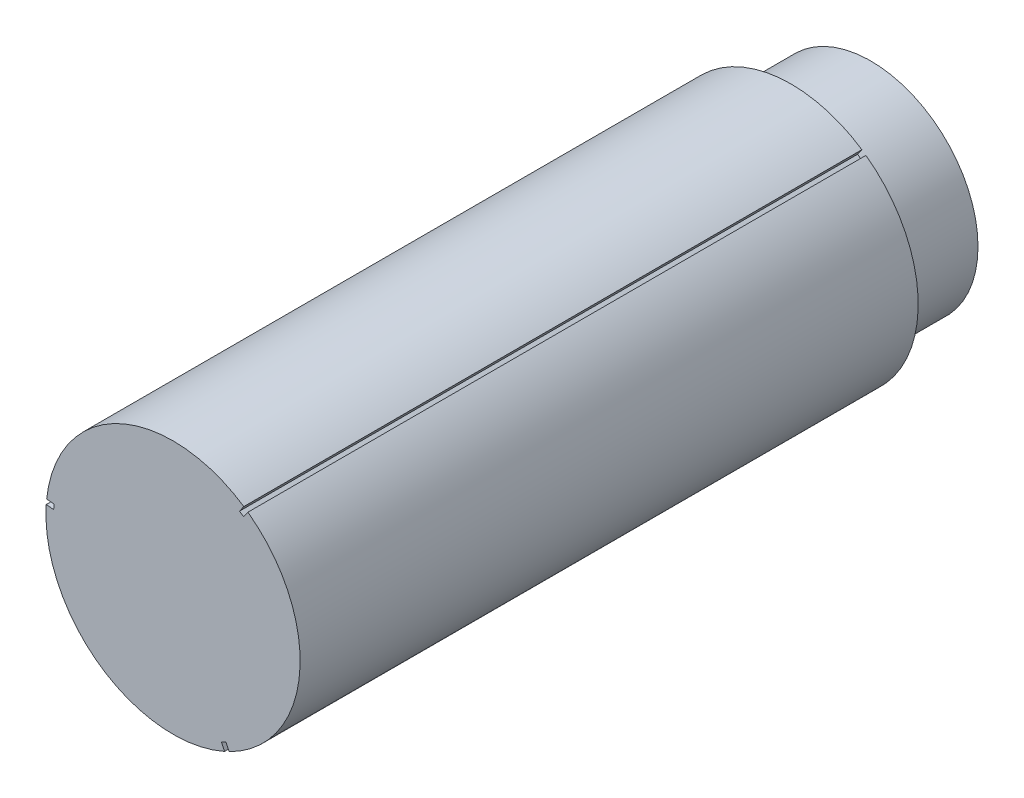
ISO-10303-21;
HEADER;
FILE_DESCRIPTION(('STEP AP214'),'2;1');
FILE_NAME('part.step','',(''),(''),'','','');
FILE_SCHEMA(('AUTOMOTIVE_DESIGN { 1 0 10303 214 1 1 1 1 }'));
ENDSEC;
DATA;
#1=APPLICATION_CONTEXT('core data for automotive mechanical design processes');
#2=APPLICATION_PROTOCOL_DEFINITION('international standard','automotive_design',2000,#1);
#3=PRODUCT_CONTEXT('',#1,'mechanical');
#4=PRODUCT('Part','Part','',(#3));
#5=PRODUCT_RELATED_PRODUCT_CATEGORY('part','',(#4));
#6=PRODUCT_DEFINITION_FORMATION('','',#4);
#7=PRODUCT_DEFINITION_CONTEXT('part definition',#1,'design');
#8=PRODUCT_DEFINITION('design','',#6,#7);
#9=PRODUCT_DEFINITION_SHAPE('','',#8);
#10=(LENGTH_UNIT() NAMED_UNIT(*) SI_UNIT(.MILLI.,.METRE.));
#11=(NAMED_UNIT(*) PLANE_ANGLE_UNIT() SI_UNIT($,.RADIAN.));
#12=(NAMED_UNIT(*) SI_UNIT($,.STERADIAN.) SOLID_ANGLE_UNIT());
#13=UNCERTAINTY_MEASURE_WITH_UNIT(LENGTH_MEASURE(1.E-05),#10,'distance_accuracy_value','');
#14=(GEOMETRIC_REPRESENTATION_CONTEXT(3) GLOBAL_UNCERTAINTY_ASSIGNED_CONTEXT((#13)) GLOBAL_UNIT_ASSIGNED_CONTEXT((#10,
#11,#12)) REPRESENTATION_CONTEXT('',''));
#15=CARTESIAN_POINT('',(0.,0.,0.));
#16=DIRECTION('',(0.,0.,1.));
#17=DIRECTION('',(1.,0.,0.));
#18=AXIS2_PLACEMENT_3D('',#15,#16,#17);
#19=CARTESIAN_POINT('',(0.,0.,70.));
#20=DIRECTION('',(0.,0.,-1.));
#21=DIRECTION('',(-1.,0.,0.));
#22=AXIS2_PLACEMENT_3D('',#19,#20,#21);
#23=CYLINDRICAL_SURFACE('',#22,12.75);
#24=CARTESIAN_POINT('',(0.,0.,8.));
#25=DIRECTION('',(0.,0.,1.));
#26=DIRECTION('',(1.,0.,0.));
#27=AXIS2_PLACEMENT_3D('',#24,#25,#26);
#28=CIRCLE('',#27,12.75);
#29=CARTESIAN_POINT('',(-12.7213210219299,0.854687929600846,8.));
#30=VERTEX_POINT('',#29);
#31=CARTESIAN_POINT('',(5.16744625111953,-11.655899761142,8.));
#32=VERTEX_POINT('',#31);
#33=EDGE_CURVE('E154',#30,#32,#28,.T.);
#34=ORIENTED_EDGE('',*,*,#33,.T.);
#35=DIRECTION('',(0.,0.,1.));
#36=VECTOR('',#35,1.);
#37=CARTESIAN_POINT('',(5.16744625111953,-11.655899761142,-0.001000000000001));
#38=LINE('',#37,#36);
#39=CARTESIAN_POINT('',(5.16744625111953,-11.655899761142,70.));
#40=VERTEX_POINT('',#39);
#41=EDGE_CURVE('E137',#32,#40,#38,.T.);
#42=ORIENTED_EDGE('',*,*,#41,.T.);
#43=CARTESIAN_POINT('',(0.,0.,70.));
#44=DIRECTION('',(0.,0.,1.));
#45=DIRECTION('',(1.,0.,0.));
#46=AXIS2_PLACEMENT_3D('',#43,#44,#45);
#47=CIRCLE('',#46,12.75);
#48=CARTESIAN_POINT('',(-12.7213210219299,0.854687929600846,70.));
#49=VERTEX_POINT('',#48);
#50=EDGE_CURVE('E162',#49,#40,#47,.T.);
#51=ORIENTED_EDGE('',*,*,#50,.F.);
#52=DIRECTION('',(0.,0.,1.));
#53=VECTOR('',#52,1.);
#54=CARTESIAN_POINT('',(-12.7213210219299,0.854687929600846,-0.001000000000001));
#55=LINE('',#54,#53);
#56=EDGE_CURVE('E219',#30,#49,#55,.T.);
#57=ORIENTED_EDGE('',*,*,#56,.F.);
#58=EDGE_LOOP('',(#34,#42,#51,#57));
#59=FACE_BOUND('',#58,.T.);
#60=ADVANCED_FACE('F40',(#59),#23,.T.);
#61=CARTESIAN_POINT('',(5.62047905162273,-11.4443311394887,70.));
#62=VERTEX_POINT('',#61);
#63=CARTESIAN_POINT('',(7.51058217155409,10.3030896067313,70.));
#64=VERTEX_POINT('',#63);
#65=EDGE_CURVE('E145',#62,#64,#47,.T.);
#66=ORIENTED_EDGE('',*,*,#65,.F.);
#67=DIRECTION('',(0.,0.,1.));
#68=VECTOR('',#67,1.);
#69=CARTESIAN_POINT('',(5.62047905162272,-11.4443311394887,-0.001000000000001));
#70=LINE('',#69,#68);
#71=CARTESIAN_POINT('',(5.62047905162273,-11.4443311394887,8.));
#72=VERTEX_POINT('',#71);
#73=EDGE_CURVE('E55',#72,#62,#70,.T.);
#74=ORIENTED_EDGE('',*,*,#73,.F.);
#75=CARTESIAN_POINT('',(7.51058217155409,10.3030896067313,8.));
#76=VERTEX_POINT('',#75);
#77=EDGE_CURVE('E143',#72,#76,#28,.T.);
#78=ORIENTED_EDGE('',*,*,#77,.T.);
#79=DIRECTION('',(0.,0.,1.));
#80=VECTOR('',#79,1.);
#81=CARTESIAN_POINT('',(7.51058217155409,10.3030896067313,-0.001000000000001));
#82=LINE('',#81,#80);
#83=EDGE_CURVE('E242',#76,#64,#82,.T.);
#84=ORIENTED_EDGE('',*,*,#83,.T.);
#85=EDGE_LOOP('',(#66,#74,#78,#84));
#86=FACE_BOUND('',#85,.T.);
#87=ADVANCED_FACE('F141',(#86),#23,.T.);
#88=CARTESIAN_POINT('',(0.,0.,0.));
#89=DIRECTION('',(0.,0.,1.));
#90=DIRECTION('',(1.,0.,0.));
#91=AXIS2_PLACEMENT_3D('',#88,#89,#90);
#92=PLANE('',#91);
#93=CARTESIAN_POINT('',(0.,0.,0.));
#94=DIRECTION('',(0.,0.,1.));
#95=DIRECTION('',(1.,0.,0.));
#96=AXIS2_PLACEMENT_3D('',#93,#94,#95);
#97=CIRCLE('',#96,10.75);
#98=CARTESIAN_POINT('',(10.75,0.,0.));
#99=VERTEX_POINT('',#98);
#100=EDGE_CURVE('E44',#99,#99,#97,.T.);
#101=ORIENTED_EDGE('',*,*,#100,.F.);
#102=EDGE_LOOP('',(#101));
#103=FACE_BOUND('',#102,.T.);
#104=CARTESIAN_POINT('',(0.,0.,0.));
#105=DIRECTION('',(0.,0.,1.));
#106=DIRECTION('',(1.,0.,0.));
#107=AXIS2_PLACEMENT_3D('',#104,#105,#106);
#108=CIRCLE('',#107,2.75);
#109=CARTESIAN_POINT('',(2.75,0.,0.));
#110=VERTEX_POINT('',#109);
#111=EDGE_CURVE('E167',#110,#110,#108,.T.);
#112=ORIENTED_EDGE('',*,*,#111,.T.);
#113=EDGE_LOOP('',(#112));
#114=FACE_BOUND('',#113,.T.);
#115=ADVANCED_FACE('F175',(#103,#114),#92,.F.);
#116=CARTESIAN_POINT('',(0.,0.,8.));
#117=DIRECTION('',(0.,0.,-1.));
#118=DIRECTION('',(-1.,0.,0.));
#119=AXIS2_PLACEMENT_3D('',#116,#117,#118);
#120=CYLINDRICAL_SURFACE('',#119,10.75);
#121=CARTESIAN_POINT('',(0.,0.,8.));
#122=DIRECTION('',(0.,0.,1.));
#123=DIRECTION('',(1.,0.,0.));
#124=AXIS2_PLACEMENT_3D('',#121,#122,#123);
#125=CIRCLE('',#124,10.75);
#126=CARTESIAN_POINT('',(10.75,0.,8.));
#127=VERTEX_POINT('',#126);
#128=EDGE_CURVE('E11',#127,#127,#125,.T.);
#129=ORIENTED_EDGE('',*,*,#128,.F.);
#130=EDGE_LOOP('',(#129));
#131=FACE_BOUND('',#130,.T.);
#132=ORIENTED_EDGE('',*,*,#100,.T.);
#133=EDGE_LOOP('',(#132));
#134=FACE_BOUND('',#133,.T.);
#135=ADVANCED_FACE('F42',(#131,#134),#120,.T.);
#136=CARTESIAN_POINT('',(0.,0.,8.));
#137=DIRECTION('',(0.,0.,-1.));
#138=DIRECTION('',(-1.,0.,0.));
#139=AXIS2_PLACEMENT_3D('',#136,#137,#138);
#140=CYLINDRICAL_SURFACE('',#139,2.75);
#141=CARTESIAN_POINT('',(0.,0.,8.));
#142=DIRECTION('',(0.,0.,1.));
#143=DIRECTION('',(1.,0.,0.));
#144=AXIS2_PLACEMENT_3D('',#141,#142,#143);
#145=CIRCLE('',#144,2.75);
#146=CARTESIAN_POINT('',(2.75,0.,8.));
#147=VERTEX_POINT('',#146);
#148=EDGE_CURVE('E164',#147,#147,#145,.T.);
#149=ORIENTED_EDGE('',*,*,#148,.T.);
#150=EDGE_LOOP('',(#149));
#151=FACE_BOUND('',#150,.T.);
#152=ORIENTED_EDGE('',*,*,#111,.F.);
#153=EDGE_LOOP('',(#152));
#154=FACE_BOUND('',#153,.T.);
#155=ADVANCED_FACE('F181',(#151,#154),#140,.F.);
#156=CARTESIAN_POINT('',(0.,0.,8.));
#157=DIRECTION('',(0.,0.,1.));
#158=DIRECTION('',(1.,0.,0.));
#159=AXIS2_PLACEMENT_3D('',#156,#157,#158);
#160=PLANE('',#159);
#161=ORIENTED_EDGE('',*,*,#148,.F.);
#162=EDGE_LOOP('',(#161));
#163=FACE_BOUND('',#162,.T.);
#164=ADVANCED_FACE('F201',(#163),#160,.F.);
#165=DIRECTION('',(0.90606560100627,0.423137243306646,0.));
#166=VECTOR('',#165,1.);
#167=CARTESIAN_POINT('',(5.3041633199313,-10.7670029012486,8.));
#168=LINE('',#167,#166);
#169=CARTESIAN_POINT('',(4.85113051942816,-10.9785715229019,8.));
#170=VERTEX_POINT('',#169);
#171=CARTESIAN_POINT('',(5.3041633199313,-10.7670029012486,8.));
#172=VERTEX_POINT('',#171);
#173=EDGE_CURVE('E274',#170,#172,#168,.T.);
#174=ORIENTED_EDGE('',*,*,#173,.F.);
#175=DIRECTION('',(-0.423137243306645,0.90606560100627,0.));
#176=VECTOR('',#175,1.);
#177=CARTESIAN_POINT('',(4.85113051942816,-10.9785715229019,8.));
#178=LINE('',#177,#176);
#179=EDGE_CURVE('E273',#32,#170,#178,.T.);
#180=ORIENTED_EDGE('',*,*,#179,.F.);
#181=ORIENTED_EDGE('',*,*,#33,.F.);
#182=DIRECTION('',(-0.996244449619968,0.086585198512263,0.));
#183=VECTOR('',#182,1.);
#184=CARTESIAN_POINT('',(-12.7213210219299,0.854687929600846,8.));
#185=LINE('',#184,#183);
#186=CARTESIAN_POINT('',(-11.9765796950677,0.789961269742166,8.));
#187=VERTEX_POINT('',#186);
#188=EDGE_CURVE('E159',#187,#30,#185,.T.);
#189=ORIENTED_EDGE('',*,*,#188,.F.);
#190=DIRECTION('',(-0.0865851985122525,-0.996244449619969,0.));
#191=VECTOR('',#190,1.);
#192=CARTESIAN_POINT('',(-11.9765796950677,0.789961269742166,8.));
#193=LINE('',#192,#191);
#194=CARTESIAN_POINT('',(-11.9332870958115,1.28808349455215,8.));
#195=VERTEX_POINT('',#194);
#196=EDGE_CURVE('E251',#195,#187,#193,.T.);
#197=ORIENTED_EDGE('',*,*,#196,.F.);
#198=DIRECTION('',(0.996244449619967,-0.0865851985122639,0.));
#199=VECTOR('',#198,1.);
#200=CARTESIAN_POINT('',(-11.9332870958115,1.28808349455215,8.));
#201=LINE('',#200,#199);
#202=CARTESIAN_POINT('',(-12.6780284226737,1.35281015441083,8.));
#203=VERTEX_POINT('',#202);
#204=EDGE_CURVE('E254',#203,#195,#201,.T.);
#205=ORIENTED_EDGE('',*,*,#204,.F.);
#206=CARTESIAN_POINT('',(7.10084197030709,10.5896432098879,8.));
#207=VERTEX_POINT('',#206);
#208=EDGE_CURVE('E155',#207,#203,#28,.T.);
#209=ORIENTED_EDGE('',*,*,#208,.F.);
#210=DIRECTION('',(0.573107206313315,0.819480402494012,0.));
#211=VECTOR('',#210,1.);
#212=CARTESIAN_POINT('',(7.10084197030709,10.5896432098879,8.));
#213=LINE('',#212,#211);
#214=CARTESIAN_POINT('',(6.67241637513627,9.97704163150647,8.));
#215=VERTEX_POINT('',#214);
#216=EDGE_CURVE('E244',#215,#207,#213,.T.);
#217=ORIENTED_EDGE('',*,*,#216,.F.);
#218=DIRECTION('',(-0.819480402494012,0.573107206313315,0.));
#219=VECTOR('',#218,1.);
#220=CARTESIAN_POINT('',(6.67241637513627,9.97704163150647,8.));
#221=LINE('',#220,#219);
#222=CARTESIAN_POINT('',(7.08215657638328,9.69048802834981,8.));
#223=VERTEX_POINT('',#222);
#224=EDGE_CURVE('E136',#223,#215,#221,.T.);
#225=ORIENTED_EDGE('',*,*,#224,.F.);
#226=DIRECTION('',(-0.573107206313315,-0.819480402494012,0.));
#227=VECTOR('',#226,1.);
#228=CARTESIAN_POINT('',(7.08215657638328,9.69048802834981,8.));
#229=LINE('',#228,#227);
#230=EDGE_CURVE('E153',#76,#223,#229,.T.);
#231=ORIENTED_EDGE('',*,*,#230,.F.);
#232=ORIENTED_EDGE('',*,*,#77,.F.);
#233=DIRECTION('',(0.423137243306728,-0.906065601006232,0.));
#234=VECTOR('',#233,1.);
#235=CARTESIAN_POINT('',(5.62047905162272,-11.4443311394887,8.));
#236=LINE('',#235,#234);
#237=EDGE_CURVE('E129',#172,#72,#236,.T.);
#238=ORIENTED_EDGE('',*,*,#237,.F.);
#239=EDGE_LOOP('',(#174,#180,#181,#189,#197,#205,#209,#217,#225,#231,#232,#238));
#240=FACE_BOUND('',#239,.T.);
#241=ORIENTED_EDGE('',*,*,#128,.T.);
#242=EDGE_LOOP('',(#241));
#243=FACE_BOUND('',#242,.T.);
#244=ADVANCED_FACE('F149',(#240,#243),#160,.F.);
#245=CARTESIAN_POINT('',(7.10084197030709,10.5896432098879,70.));
#246=VERTEX_POINT('',#245);
#247=CARTESIAN_POINT('',(-12.6780284226737,1.35281015441083,70.));
#248=VERTEX_POINT('',#247);
#249=EDGE_CURVE('E158',#246,#248,#47,.T.);
#250=ORIENTED_EDGE('',*,*,#249,.F.);
#251=DIRECTION('',(0.,0.,1.));
#252=VECTOR('',#251,1.);
#253=CARTESIAN_POINT('',(7.10084197030709,10.5896432098879,-0.001000000000001));
#254=LINE('',#253,#252);
#255=EDGE_CURVE('E63',#207,#246,#254,.T.);
#256=ORIENTED_EDGE('',*,*,#255,.F.);
#257=ORIENTED_EDGE('',*,*,#208,.T.);
#258=DIRECTION('',(0.,0.,1.));
#259=VECTOR('',#258,1.);
#260=CARTESIAN_POINT('',(-12.6780284226737,1.35281015441083,-0.001000000000001));
#261=LINE('',#260,#259);
#262=EDGE_CURVE('E206',#203,#248,#261,.T.);
#263=ORIENTED_EDGE('',*,*,#262,.T.);
#264=EDGE_LOOP('',(#250,#256,#257,#263));
#265=FACE_BOUND('',#264,.T.);
#266=ADVANCED_FACE('F184',(#265),#23,.T.);
#267=CARTESIAN_POINT('',(0.,0.,70.));
#268=DIRECTION('',(0.,0.,1.));
#269=DIRECTION('',(1.,0.,0.));
#270=AXIS2_PLACEMENT_3D('',#267,#268,#269);
#271=PLANE('',#270);
#272=DIRECTION('',(0.423137243306645,-0.90606560100627,0.));
#273=VECTOR('',#272,1.);
#274=CARTESIAN_POINT('',(4.85113051942816,-10.9785715229019,70.));
#275=LINE('',#274,#273);
#276=CARTESIAN_POINT('',(4.85113051942816,-10.9785715229019,70.));
#277=VERTEX_POINT('',#276);
#278=EDGE_CURVE('E146',#277,#40,#275,.T.);
#279=ORIENTED_EDGE('',*,*,#278,.F.);
#280=DIRECTION('',(-0.906065601006269,-0.423137243306646,0.));
#281=VECTOR('',#280,1.);
#282=CARTESIAN_POINT('',(5.3041633199313,-10.7670029012486,70.));
#283=LINE('',#282,#281);
#284=CARTESIAN_POINT('',(5.3041633199313,-10.7670029012486,70.));
#285=VERTEX_POINT('',#284);
#286=EDGE_CURVE('E277',#285,#277,#283,.T.);
#287=ORIENTED_EDGE('',*,*,#286,.F.);
#288=DIRECTION('',(-0.423137243306728,0.906065601006231,0.));
#289=VECTOR('',#288,1.);
#290=CARTESIAN_POINT('',(5.62047905162272,-11.4443311394887,70.));
#291=LINE('',#290,#289);
#292=EDGE_CURVE('E275',#62,#285,#291,.T.);
#293=ORIENTED_EDGE('',*,*,#292,.F.);
#294=ORIENTED_EDGE('',*,*,#65,.T.);
#295=DIRECTION('',(0.573107206313315,0.819480402494012,0.));
#296=VECTOR('',#295,1.);
#297=CARTESIAN_POINT('',(7.08215657638328,9.69048802834981,70.));
#298=LINE('',#297,#296);
#299=CARTESIAN_POINT('',(7.08215657638328,9.69048802834981,70.));
#300=VERTEX_POINT('',#299);
#301=EDGE_CURVE('E239',#300,#64,#298,.T.);
#302=ORIENTED_EDGE('',*,*,#301,.F.);
#303=DIRECTION('',(0.819480402494012,-0.573107206313315,0.));
#304=VECTOR('',#303,1.);
#305=CARTESIAN_POINT('',(6.67241637513627,9.97704163150647,70.));
#306=LINE('',#305,#304);
#307=CARTESIAN_POINT('',(6.67241637513627,9.97704163150647,70.));
#308=VERTEX_POINT('',#307);
#309=EDGE_CURVE('E236',#308,#300,#306,.T.);
#310=ORIENTED_EDGE('',*,*,#309,.F.);
#311=DIRECTION('',(-0.573107206313315,-0.819480402494012,0.));
#312=VECTOR('',#311,1.);
#313=CARTESIAN_POINT('',(7.10084197030709,10.5896432098879,70.));
#314=LINE('',#313,#312);
#315=EDGE_CURVE('E234',#246,#308,#314,.T.);
#316=ORIENTED_EDGE('',*,*,#315,.F.);
#317=ORIENTED_EDGE('',*,*,#249,.T.);
#318=DIRECTION('',(-0.996244449619967,0.0865851985122639,0.));
#319=VECTOR('',#318,1.);
#320=CARTESIAN_POINT('',(-11.9332870958115,1.28808349455215,70.));
#321=LINE('',#320,#319);
#322=CARTESIAN_POINT('',(-11.9332870958115,1.28808349455215,70.));
#323=VERTEX_POINT('',#322);
#324=EDGE_CURVE('E261',#323,#248,#321,.T.);
#325=ORIENTED_EDGE('',*,*,#324,.F.);
#326=DIRECTION('',(0.0865851985122524,0.996244449619968,0.));
#327=VECTOR('',#326,1.);
#328=CARTESIAN_POINT('',(-11.9765796950677,0.789961269742166,70.));
#329=LINE('',#328,#327);
#330=CARTESIAN_POINT('',(-11.9765796950677,0.789961269742166,70.));
#331=VERTEX_POINT('',#330);
#332=EDGE_CURVE('E258',#331,#323,#329,.T.);
#333=ORIENTED_EDGE('',*,*,#332,.F.);
#334=DIRECTION('',(0.996244449619967,-0.086585198512263,0.));
#335=VECTOR('',#334,1.);
#336=CARTESIAN_POINT('',(-12.7213210219299,0.854687929600846,70.));
#337=LINE('',#336,#335);
#338=EDGE_CURVE('E216',#49,#331,#337,.T.);
#339=ORIENTED_EDGE('',*,*,#338,.F.);
#340=ORIENTED_EDGE('',*,*,#50,.T.);
#341=EDGE_LOOP('',(#279,#287,#293,#294,#302,#310,#316,#317,#325,#333,#339,#340));
#342=FACE_BOUND('',#341,.T.);
#343=ADVANCED_FACE('F192',(#342),#271,.T.);
#344=CARTESIAN_POINT('',(-11.9332870958115,1.28808349455215,-0.001000000000001));
#345=DIRECTION('',(0.0865851985122639,0.996244449619968,0.));
#346=DIRECTION('',(-0.996244449619967,0.0865851985122639,0.));
#347=AXIS2_PLACEMENT_3D('',#344,#345,#346);
#348=PLANE('',#347);
#349=ORIENTED_EDGE('',*,*,#204,.T.);
#350=DIRECTION('',(0.,0.,1.));
#351=VECTOR('',#350,1.);
#352=CARTESIAN_POINT('',(-11.9332870958115,1.28808349455215,-0.001000000000001));
#353=LINE('',#352,#351);
#354=EDGE_CURVE('E264',#195,#323,#353,.T.);
#355=ORIENTED_EDGE('',*,*,#354,.T.);
#356=ORIENTED_EDGE('',*,*,#324,.T.);
#357=ORIENTED_EDGE('',*,*,#262,.F.);
#358=EDGE_LOOP('',(#349,#355,#356,#357));
#359=FACE_BOUND('',#358,.T.);
#360=ADVANCED_FACE('F198',(#359),#348,.F.);
#361=CARTESIAN_POINT('',(-11.9765796950677,0.789961269742166,-0.001000000000001));
#362=DIRECTION('',(0.996244449619968,-0.0865851985122525,0.));
#363=DIRECTION('',(0.0865851985122525,0.996244449619969,0.));
#364=AXIS2_PLACEMENT_3D('',#361,#362,#363);
#365=PLANE('',#364);
#366=ORIENTED_EDGE('',*,*,#196,.T.);
#367=DIRECTION('',(0.,0.,1.));
#368=VECTOR('',#367,1.);
#369=CARTESIAN_POINT('',(-11.9765796950677,0.789961269742166,-0.001000000000001));
#370=LINE('',#369,#368);
#371=EDGE_CURVE('E266',#187,#331,#370,.T.);
#372=ORIENTED_EDGE('',*,*,#371,.T.);
#373=ORIENTED_EDGE('',*,*,#332,.T.);
#374=ORIENTED_EDGE('',*,*,#354,.F.);
#375=EDGE_LOOP('',(#366,#372,#373,#374));
#376=FACE_BOUND('',#375,.T.);
#377=ADVANCED_FACE('F294',(#376),#365,.F.);
#378=CARTESIAN_POINT('',(-12.7213210219299,0.854687929600846,-0.001000000000001));
#379=DIRECTION('',(-0.086585198512263,-0.996244449619968,0.));
#380=DIRECTION('',(0.996244449619968,-0.086585198512263,0.));
#381=AXIS2_PLACEMENT_3D('',#378,#379,#380);
#382=PLANE('',#381);
#383=ORIENTED_EDGE('',*,*,#188,.T.);
#384=ORIENTED_EDGE('',*,*,#56,.T.);
#385=ORIENTED_EDGE('',*,*,#338,.T.);
#386=ORIENTED_EDGE('',*,*,#371,.F.);
#387=EDGE_LOOP('',(#383,#384,#385,#386));
#388=FACE_BOUND('',#387,.T.);
#389=ADVANCED_FACE('F270',(#388),#382,.F.);
#390=CARTESIAN_POINT('',(7.08215657638328,9.69048802834981,-0.001000000000001));
#391=DIRECTION('',(0.819480402494012,-0.573107206313315,0.));
#392=DIRECTION('',(0.573107206313315,0.819480402494012,0.));
#393=AXIS2_PLACEMENT_3D('',#390,#391,#392);
#394=PLANE('',#393);
#395=ORIENTED_EDGE('',*,*,#230,.T.);
#396=DIRECTION('',(0.,0.,1.));
#397=VECTOR('',#396,1.);
#398=CARTESIAN_POINT('',(7.08215657638328,9.69048802834981,-0.001000000000001));
#399=LINE('',#398,#397);
#400=EDGE_CURVE('E245',#223,#300,#399,.T.);
#401=ORIENTED_EDGE('',*,*,#400,.T.);
#402=ORIENTED_EDGE('',*,*,#301,.T.);
#403=ORIENTED_EDGE('',*,*,#83,.F.);
#404=EDGE_LOOP('',(#395,#401,#402,#403));
#405=FACE_BOUND('',#404,.T.);
#406=ADVANCED_FACE('F287',(#405),#394,.F.);
#407=CARTESIAN_POINT('',(6.67241637513627,9.97704163150647,-0.001000000000001));
#408=DIRECTION('',(-0.573107206313315,-0.819480402494012,0.));
#409=DIRECTION('',(0.819480402494012,-0.573107206313315,0.));
#410=AXIS2_PLACEMENT_3D('',#407,#408,#409);
#411=PLANE('',#410);
#412=ORIENTED_EDGE('',*,*,#224,.T.);
#413=DIRECTION('',(0.,0.,1.));
#414=VECTOR('',#413,1.);
#415=CARTESIAN_POINT('',(6.67241637513627,9.97704163150647,-0.001000000000001));
#416=LINE('',#415,#414);
#417=EDGE_CURVE('E247',#215,#308,#416,.T.);
#418=ORIENTED_EDGE('',*,*,#417,.T.);
#419=ORIENTED_EDGE('',*,*,#309,.T.);
#420=ORIENTED_EDGE('',*,*,#400,.F.);
#421=EDGE_LOOP('',(#412,#418,#419,#420));
#422=FACE_BOUND('',#421,.T.);
#423=ADVANCED_FACE('F289',(#422),#411,.F.);
#424=CARTESIAN_POINT('',(7.10084197030709,10.5896432098879,-0.001000000000001));
#425=DIRECTION('',(-0.819480402494012,0.573107206313315,0.));
#426=DIRECTION('',(-0.573107206313315,-0.819480402494012,0.));
#427=AXIS2_PLACEMENT_3D('',#424,#425,#426);
#428=PLANE('',#427);
#429=ORIENTED_EDGE('',*,*,#216,.T.);
#430=ORIENTED_EDGE('',*,*,#255,.T.);
#431=ORIENTED_EDGE('',*,*,#315,.T.);
#432=ORIENTED_EDGE('',*,*,#417,.F.);
#433=EDGE_LOOP('',(#429,#430,#431,#432));
#434=FACE_BOUND('',#433,.T.);
#435=ADVANCED_FACE('F290',(#434),#428,.F.);
#436=CARTESIAN_POINT('',(4.85113051942816,-10.9785715229019,-0.001000000000001));
#437=DIRECTION('',(-0.90606560100627,-0.423137243306645,0.));
#438=DIRECTION('',(0.423137243306645,-0.90606560100627,0.));
#439=AXIS2_PLACEMENT_3D('',#436,#437,#438);
#440=PLANE('',#439);
#441=ORIENTED_EDGE('',*,*,#179,.T.);
#442=DIRECTION('',(0.,0.,1.));
#443=VECTOR('',#442,1.);
#444=CARTESIAN_POINT('',(4.85113051942816,-10.9785715229019,-0.001000000000001));
#445=LINE('',#444,#443);
#446=EDGE_CURVE('E224',#170,#277,#445,.T.);
#447=ORIENTED_EDGE('',*,*,#446,.T.);
#448=ORIENTED_EDGE('',*,*,#278,.T.);
#449=ORIENTED_EDGE('',*,*,#41,.F.);
#450=EDGE_LOOP('',(#441,#447,#448,#449));
#451=FACE_BOUND('',#450,.T.);
#452=ADVANCED_FACE('F282',(#451),#440,.F.);
#453=CARTESIAN_POINT('',(5.3041633199313,-10.7670029012486,-0.001000000000001));
#454=DIRECTION('',(-0.423137243306646,0.906065601006269,0.));
#455=DIRECTION('',(-0.90606560100627,-0.423137243306646,0.));
#456=AXIS2_PLACEMENT_3D('',#453,#454,#455);
#457=PLANE('',#456);
#458=ORIENTED_EDGE('',*,*,#173,.T.);
#459=DIRECTION('',(0.,0.,1.));
#460=VECTOR('',#459,1.);
#461=CARTESIAN_POINT('',(5.3041633199313,-10.7670029012486,-0.001000000000001));
#462=LINE('',#461,#460);
#463=EDGE_CURVE('E131',#172,#285,#462,.T.);
#464=ORIENTED_EDGE('',*,*,#463,.T.);
#465=ORIENTED_EDGE('',*,*,#286,.T.);
#466=ORIENTED_EDGE('',*,*,#446,.F.);
#467=EDGE_LOOP('',(#458,#464,#465,#466));
#468=FACE_BOUND('',#467,.T.);
#469=ADVANCED_FACE('F283',(#468),#457,.F.);
#470=CARTESIAN_POINT('',(5.62047905162272,-11.4443311394887,-0.001000000000001));
#471=DIRECTION('',(0.906065601006231,0.423137243306728,0.));
#472=DIRECTION('',(-0.423137243306728,0.906065601006232,0.));
#473=AXIS2_PLACEMENT_3D('',#470,#471,#472);
#474=PLANE('',#473);
#475=ORIENTED_EDGE('',*,*,#237,.T.);
#476=ORIENTED_EDGE('',*,*,#73,.T.);
#477=ORIENTED_EDGE('',*,*,#292,.T.);
#478=ORIENTED_EDGE('',*,*,#463,.F.);
#479=EDGE_LOOP('',(#475,#476,#477,#478));
#480=FACE_BOUND('',#479,.T.);
#481=ADVANCED_FACE('F130',(#480),#474,.F.);
#482=CLOSED_SHELL('',(#60,#87,#115,#135,#155,#164,#244,#266,#343,#360,#377,#389,#406,#423,#435,
#452,#469,#481));
#483=MANIFOLD_SOLID_BREP('B2',#482);
#484=ADVANCED_BREP_SHAPE_REPRESENTATION('',(#18,#483),#14);
#485=SHAPE_DEFINITION_REPRESENTATION(#9,#484);
ENDSEC;
END-ISO-10303-21;
